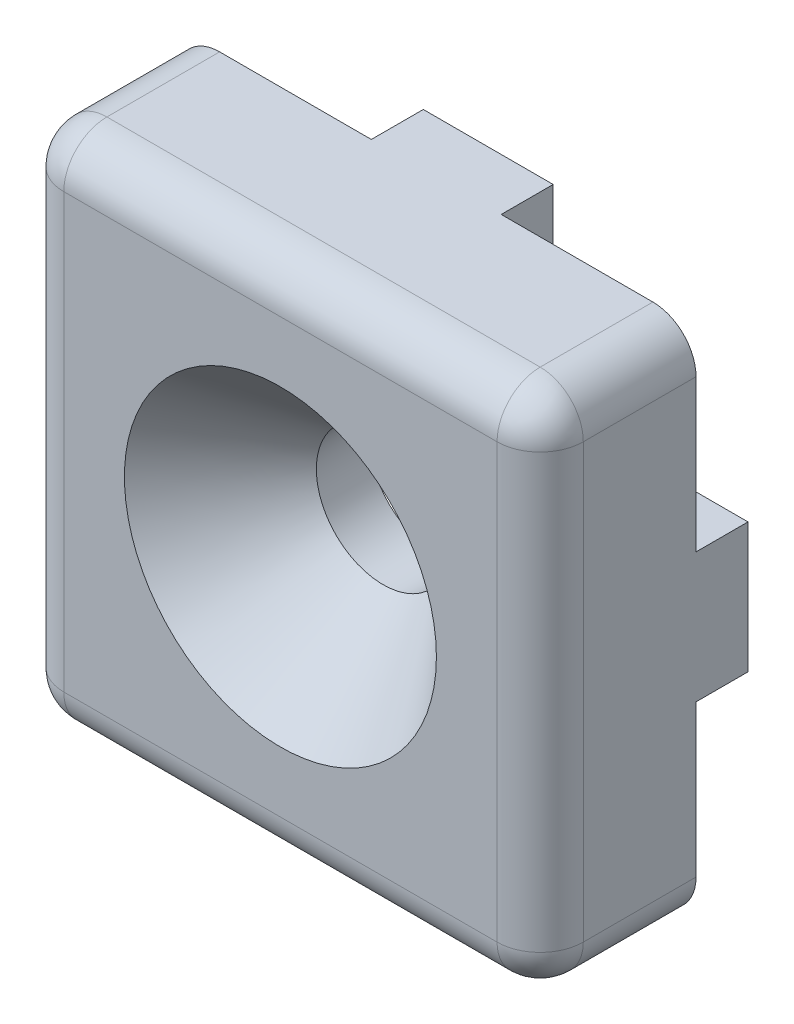
ISO-10303-21;
HEADER;
FILE_DESCRIPTION(('STEP AP214'),'2;1');
FILE_NAME('part.step','',(''),(''),'','','');
FILE_SCHEMA(('AUTOMOTIVE_DESIGN { 1 0 10303 214 1 1 1 1 }'));
ENDSEC;
DATA;
#1=APPLICATION_CONTEXT('core data for automotive mechanical design processes');
#2=APPLICATION_PROTOCOL_DEFINITION('international standard','automotive_design',2000,#1);
#3=PRODUCT_CONTEXT('',#1,'mechanical');
#4=PRODUCT('Part','Part','',(#3));
#5=PRODUCT_RELATED_PRODUCT_CATEGORY('part','',(#4));
#6=PRODUCT_DEFINITION_FORMATION('','',#4);
#7=PRODUCT_DEFINITION_CONTEXT('part definition',#1,'design');
#8=PRODUCT_DEFINITION('design','',#6,#7);
#9=PRODUCT_DEFINITION_SHAPE('','',#8);
#10=(LENGTH_UNIT() NAMED_UNIT(*) SI_UNIT(.MILLI.,.METRE.));
#11=(NAMED_UNIT(*) PLANE_ANGLE_UNIT() SI_UNIT($,.RADIAN.));
#12=(NAMED_UNIT(*) SI_UNIT($,.STERADIAN.) SOLID_ANGLE_UNIT());
#13=UNCERTAINTY_MEASURE_WITH_UNIT(LENGTH_MEASURE(1.E-05),#10,'distance_accuracy_value','');
#14=(GEOMETRIC_REPRESENTATION_CONTEXT(3) GLOBAL_UNCERTAINTY_ASSIGNED_CONTEXT((#13)) GLOBAL_UNIT_ASSIGNED_CONTEXT((#10,
#11,#12)) REPRESENTATION_CONTEXT('',''));
#15=CARTESIAN_POINT('',(0.,0.,0.));
#16=DIRECTION('',(0.,0.,1.));
#17=DIRECTION('',(1.,0.,0.));
#18=AXIS2_PLACEMENT_3D('',#15,#16,#17);
#19=CARTESIAN_POINT('',(0.,0.,-3.81));
#20=DIRECTION('',(0.,0.,-1.));
#21=DIRECTION('',(-1.,0.,0.));
#22=AXIS2_PLACEMENT_3D('',#19,#20,#21);
#23=PLANE('',#22);
#24=CARTESIAN_POINT('',(0.,0.,-3.81));
#25=DIRECTION('',(0.,0.,1.));
#26=DIRECTION('',(1.,0.,0.));
#27=AXIS2_PLACEMENT_3D('',#24,#25,#26);
#28=CIRCLE('',#27,3.2639);
#29=CARTESIAN_POINT('',(3.2639,0.,-3.81));
#30=VERTEX_POINT('',#29);
#31=EDGE_CURVE('E323',#30,#30,#28,.T.);
#32=ORIENTED_EDGE('',*,*,#31,.T.);
#33=EDGE_LOOP('',(#32));
#34=FACE_BOUND('',#33,.T.);
#35=DIRECTION('',(1.,0.,0.));
#36=VECTOR('',#35,1.);
#37=CARTESIAN_POINT('',(-3.1749999999999,-10.16,-3.81));
#38=LINE('',#37,#36);
#39=CARTESIAN_POINT('',(-3.1749999999999,-10.16,-3.81));
#40=VERTEX_POINT('',#39);
#41=CARTESIAN_POINT('',(3.17500000000011,-10.16,-3.81));
#42=VERTEX_POINT('',#41);
#43=EDGE_CURVE('E565',#40,#42,#38,.T.);
#44=ORIENTED_EDGE('',*,*,#43,.F.);
#45=DIRECTION('',(0.,1.,0.));
#46=VECTOR('',#45,1.);
#47=CARTESIAN_POINT('',(-3.17499999999987,-12.7,-3.81));
#48=LINE('',#47,#46);
#49=CARTESIAN_POINT('',(-3.17499999999987,-12.7,-3.81));
#50=VERTEX_POINT('',#49);
#51=EDGE_CURVE('E230',#50,#40,#48,.T.);
#52=ORIENTED_EDGE('',*,*,#51,.F.);
#53=DIRECTION('',(1.,0.,0.));
#54=VECTOR('',#53,1.);
#55=CARTESIAN_POINT('',(-12.7,-12.7,-3.81));
#56=LINE('',#55,#54);
#57=CARTESIAN_POINT('',(-10.5918,-12.7,-3.81));
#58=VERTEX_POINT('',#57);
#59=EDGE_CURVE('E339',#58,#50,#56,.T.);
#60=ORIENTED_EDGE('',*,*,#59,.F.);
#61=CARTESIAN_POINT('',(-10.5918,-10.5918,-3.81));
#62=DIRECTION('',(0.,0.,-1.));
#63=DIRECTION('',(-1.,0.,0.));
#64=AXIS2_PLACEMENT_3D('',#61,#62,#63);
#65=CIRCLE('',#64,2.1082);
#66=CARTESIAN_POINT('',(-12.7,-10.5918,-3.81));
#67=VERTEX_POINT('',#66);
#68=EDGE_CURVE('E41',#58,#67,#65,.T.);
#69=ORIENTED_EDGE('',*,*,#68,.T.);
#70=DIRECTION('',(0.,-1.,0.));
#71=VECTOR('',#70,1.);
#72=CARTESIAN_POINT('',(-12.7,-12.7,-3.81));
#73=LINE('',#72,#71);
#74=CARTESIAN_POINT('',(-12.7,-3.17500000000009,-3.81));
#75=VERTEX_POINT('',#74);
#76=EDGE_CURVE('E334',#75,#67,#73,.T.);
#77=ORIENTED_EDGE('',*,*,#76,.F.);
#78=DIRECTION('',(-1.,0.,0.));
#79=VECTOR('',#78,1.);
#80=CARTESIAN_POINT('',(-12.7,-3.17500000000009,-3.81));
#81=LINE('',#80,#79);
#82=CARTESIAN_POINT('',(-10.16,-3.17500000000007,-3.81));
#83=VERTEX_POINT('',#82);
#84=EDGE_CURVE('E244',#83,#75,#81,.T.);
#85=ORIENTED_EDGE('',*,*,#84,.F.);
#86=DIRECTION('',(0.,-1.,0.));
#87=VECTOR('',#86,1.);
#88=CARTESIAN_POINT('',(-10.16,3.17499999999993,-3.81));
#89=LINE('',#88,#87);
#90=CARTESIAN_POINT('',(-10.16,3.17499999999993,-3.81));
#91=VERTEX_POINT('',#90);
#92=EDGE_CURVE('E235',#91,#83,#89,.T.);
#93=ORIENTED_EDGE('',*,*,#92,.F.);
#94=DIRECTION('',(1.,0.,0.));
#95=VECTOR('',#94,1.);
#96=CARTESIAN_POINT('',(-12.7,3.17499999999991,-3.81));
#97=LINE('',#96,#95);
#98=CARTESIAN_POINT('',(-12.7,3.17499999999991,-3.81));
#99=VERTEX_POINT('',#98);
#100=EDGE_CURVE('E232',#99,#91,#97,.T.);
#101=ORIENTED_EDGE('',*,*,#100,.F.);
#102=CARTESIAN_POINT('',(-12.7,10.5918,-3.81));
#103=VERTEX_POINT('',#102);
#104=EDGE_CURVE('E335',#103,#99,#73,.T.);
#105=ORIENTED_EDGE('',*,*,#104,.F.);
#106=CARTESIAN_POINT('',(-10.5918,10.5918,-3.81));
#107=DIRECTION('',(0.,0.,-1.));
#108=DIRECTION('',(-1.,0.,0.));
#109=AXIS2_PLACEMENT_3D('',#106,#107,#108);
#110=CIRCLE('',#109,2.1082);
#111=CARTESIAN_POINT('',(-10.5918,12.7,-3.81));
#112=VERTEX_POINT('',#111);
#113=EDGE_CURVE('E376',#103,#112,#110,.T.);
#114=ORIENTED_EDGE('',*,*,#113,.T.);
#115=DIRECTION('',(-1.,0.,0.));
#116=VECTOR('',#115,1.);
#117=CARTESIAN_POINT('',(-12.7,12.7,-3.81));
#118=LINE('',#117,#116);
#119=CARTESIAN_POINT('',(-3.17500000000004,12.7,-3.81));
#120=VERTEX_POINT('',#119);
#121=EDGE_CURVE('E330',#120,#112,#118,.T.);
#122=ORIENTED_EDGE('',*,*,#121,.F.);
#123=DIRECTION('',(0.,1.,0.));
#124=VECTOR('',#123,1.);
#125=CARTESIAN_POINT('',(-3.17500000000004,12.7,-3.81));
#126=LINE('',#125,#124);
#127=CARTESIAN_POINT('',(-3.17500000000003,10.16,-3.81));
#128=VERTEX_POINT('',#127);
#129=EDGE_CURVE('E265',#128,#120,#126,.T.);
#130=ORIENTED_EDGE('',*,*,#129,.F.);
#131=DIRECTION('',(-1.,0.,0.));
#132=VECTOR('',#131,1.);
#133=CARTESIAN_POINT('',(3.17499999999997,10.16,-3.81));
#134=LINE('',#133,#132);
#135=CARTESIAN_POINT('',(3.17499999999997,10.16,-3.81));
#136=VERTEX_POINT('',#135);
#137=EDGE_CURVE('E274',#136,#128,#134,.T.);
#138=ORIENTED_EDGE('',*,*,#137,.F.);
#139=DIRECTION('',(0.,-1.,0.));
#140=VECTOR('',#139,1.);
#141=CARTESIAN_POINT('',(3.17499999999996,12.7,-3.81));
#142=LINE('',#141,#140);
#143=CARTESIAN_POINT('',(3.17499999999996,12.7,-3.81));
#144=VERTEX_POINT('',#143);
#145=EDGE_CURVE('E260',#144,#136,#142,.T.);
#146=ORIENTED_EDGE('',*,*,#145,.F.);
#147=CARTESIAN_POINT('',(10.5918,12.7,-3.81));
#148=VERTEX_POINT('',#147);
#149=EDGE_CURVE('E331',#148,#144,#118,.T.);
#150=ORIENTED_EDGE('',*,*,#149,.F.);
#151=CARTESIAN_POINT('',(10.5918,10.5918,-3.81));
#152=DIRECTION('',(0.,0.,-1.));
#153=DIRECTION('',(-1.,0.,0.));
#154=AXIS2_PLACEMENT_3D('',#151,#152,#153);
#155=CIRCLE('',#154,2.1082);
#156=CARTESIAN_POINT('',(12.7,10.5918,-3.81));
#157=VERTEX_POINT('',#156);
#158=EDGE_CURVE('E379',#148,#157,#155,.T.);
#159=ORIENTED_EDGE('',*,*,#158,.T.);
#160=DIRECTION('',(0.,1.,0.));
#161=VECTOR('',#160,1.);
#162=CARTESIAN_POINT('',(12.7,-12.7,-3.81));
#163=LINE('',#162,#161);
#164=CARTESIAN_POINT('',(12.7,3.175,-3.81));
#165=VERTEX_POINT('',#164);
#166=EDGE_CURVE('E326',#165,#157,#163,.T.);
#167=ORIENTED_EDGE('',*,*,#166,.F.);
#168=DIRECTION('',(1.,0.,0.));
#169=VECTOR('',#168,1.);
#170=CARTESIAN_POINT('',(12.7,3.175,-3.81));
#171=LINE('',#170,#169);
#172=CARTESIAN_POINT('',(10.16,3.175,-3.81));
#173=VERTEX_POINT('',#172);
#174=EDGE_CURVE('E291',#173,#165,#171,.T.);
#175=ORIENTED_EDGE('',*,*,#174,.F.);
#176=DIRECTION('',(0.,1.,0.));
#177=VECTOR('',#176,1.);
#178=CARTESIAN_POINT('',(10.16,-3.175,-3.81));
#179=LINE('',#178,#177);
#180=CARTESIAN_POINT('',(10.16,-3.175,-3.81));
#181=VERTEX_POINT('',#180);
#182=EDGE_CURVE('E300',#181,#173,#179,.T.);
#183=ORIENTED_EDGE('',*,*,#182,.F.);
#184=DIRECTION('',(-1.,0.,0.));
#185=VECTOR('',#184,1.);
#186=CARTESIAN_POINT('',(12.7,-3.175,-3.81));
#187=LINE('',#186,#185);
#188=CARTESIAN_POINT('',(12.7,-3.175,-3.81));
#189=VERTEX_POINT('',#188);
#190=EDGE_CURVE('E286',#189,#181,#187,.T.);
#191=ORIENTED_EDGE('',*,*,#190,.F.);
#192=CARTESIAN_POINT('',(12.7,-10.5918,-3.81));
#193=VERTEX_POINT('',#192);
#194=EDGE_CURVE('E327',#193,#189,#163,.T.);
#195=ORIENTED_EDGE('',*,*,#194,.F.);
#196=CARTESIAN_POINT('',(10.5918,-10.5918,-3.81));
#197=DIRECTION('',(0.,0.,-1.));
#198=DIRECTION('',(-1.,0.,0.));
#199=AXIS2_PLACEMENT_3D('',#196,#197,#198);
#200=CIRCLE('',#199,2.1082);
#201=CARTESIAN_POINT('',(10.5918,-12.7,-3.81));
#202=VERTEX_POINT('',#201);
#203=EDGE_CURVE('E11',#193,#202,#200,.T.);
#204=ORIENTED_EDGE('',*,*,#203,.T.);
#205=CARTESIAN_POINT('',(3.17500000000013,-12.7,-3.81));
#206=VERTEX_POINT('',#205);
#207=EDGE_CURVE('E338',#206,#202,#56,.T.);
#208=ORIENTED_EDGE('',*,*,#207,.F.);
#209=DIRECTION('',(0.,-1.,0.));
#210=VECTOR('',#209,1.);
#211=CARTESIAN_POINT('',(3.17500000000013,-12.7,-3.81));
#212=LINE('',#211,#210);
#213=EDGE_CURVE('E226',#42,#206,#212,.T.);
#214=ORIENTED_EDGE('',*,*,#213,.F.);
#215=EDGE_LOOP('',(#44,#52,#60,#69,#77,#85,#93,#101,#105,#114,#122,#130,#138,#146,#150,#159,
#167,#175,#183,#191,#195,#204,#208,#214));
#216=FACE_BOUND('',#215,.T.);
#217=ADVANCED_FACE('F32',(#34,#216),#23,.T.);
#218=CARTESIAN_POINT('',(12.7,-12.7,3.81));
#219=DIRECTION('',(-1.,0.,0.));
#220=DIRECTION('',(0.,0.,1.));
#221=AXIS2_PLACEMENT_3D('',#218,#219,#220);
#222=PLANE('',#221);
#223=DIRECTION('',(0.,1.,0.));
#224=VECTOR('',#223,1.);
#225=CARTESIAN_POINT('',(12.7,-12.7,1.7018));
#226=LINE('',#225,#224);
#227=CARTESIAN_POINT('',(12.7,10.5918,1.7018));
#228=VERTEX_POINT('',#227);
#229=CARTESIAN_POINT('',(12.7,-10.5918,1.7018));
#230=VERTEX_POINT('',#229);
#231=EDGE_CURVE('E366',#228,#230,#226,.F.);
#232=ORIENTED_EDGE('',*,*,#231,.T.);
#233=DIRECTION('',(0.,0.,-1.));
#234=VECTOR('',#233,1.);
#235=CARTESIAN_POINT('',(12.7,-10.5918,3.81));
#236=LINE('',#235,#234);
#237=EDGE_CURVE('E368',#230,#193,#236,.T.);
#238=ORIENTED_EDGE('',*,*,#237,.T.);
#239=ORIENTED_EDGE('',*,*,#194,.T.);
#240=DIRECTION('',(0.,0.,1.));
#241=VECTOR('',#240,1.);
#242=CARTESIAN_POINT('',(12.7,-3.175,-6.35));
#243=LINE('',#242,#241);
#244=CARTESIAN_POINT('',(12.7,-3.175,-6.35));
#245=VERTEX_POINT('',#244);
#246=EDGE_CURVE('E313',#245,#189,#243,.T.);
#247=ORIENTED_EDGE('',*,*,#246,.F.);
#248=DIRECTION('',(0.,-1.,0.));
#249=VECTOR('',#248,1.);
#250=CARTESIAN_POINT('',(12.7,-3.175,-6.35));
#251=LINE('',#250,#249);
#252=CARTESIAN_POINT('',(12.7,3.175,-6.35));
#253=VERTEX_POINT('',#252);
#254=EDGE_CURVE('E287',#253,#245,#251,.T.);
#255=ORIENTED_EDGE('',*,*,#254,.F.);
#256=DIRECTION('',(0.,0.,1.));
#257=VECTOR('',#256,1.);
#258=CARTESIAN_POINT('',(12.7,3.175,-6.35));
#259=LINE('',#258,#257);
#260=EDGE_CURVE('E297',#253,#165,#259,.T.);
#261=ORIENTED_EDGE('',*,*,#260,.T.);
#262=ORIENTED_EDGE('',*,*,#166,.T.);
#263=DIRECTION('',(0.,0.,-1.));
#264=VECTOR('',#263,1.);
#265=CARTESIAN_POINT('',(12.7,10.5918,3.81));
#266=LINE('',#265,#264);
#267=EDGE_CURVE('E364',#157,#228,#266,.F.);
#268=ORIENTED_EDGE('',*,*,#267,.T.);
#269=EDGE_LOOP('',(#232,#238,#239,#247,#255,#261,#262,#268));
#270=FACE_BOUND('',#269,.T.);
#271=ADVANCED_FACE('F440',(#270),#222,.F.);
#272=CARTESIAN_POINT('',(-12.7,12.7,3.81));
#273=DIRECTION('',(0.,-1.,0.));
#274=DIRECTION('',(0.,0.,-1.));
#275=AXIS2_PLACEMENT_3D('',#272,#273,#274);
#276=PLANE('',#275);
#277=DIRECTION('',(-1.,0.,0.));
#278=VECTOR('',#277,1.);
#279=CARTESIAN_POINT('',(-12.7,12.7,1.7018));
#280=LINE('',#279,#278);
#281=CARTESIAN_POINT('',(-10.5918,12.7,1.7018));
#282=VERTEX_POINT('',#281);
#283=CARTESIAN_POINT('',(10.5918,12.7,1.7018));
#284=VERTEX_POINT('',#283);
#285=EDGE_CURVE('E360',#282,#284,#280,.F.);
#286=ORIENTED_EDGE('',*,*,#285,.T.);
#287=DIRECTION('',(0.,0.,-1.));
#288=VECTOR('',#287,1.);
#289=CARTESIAN_POINT('',(10.5918,12.7,3.81));
#290=LINE('',#289,#288);
#291=EDGE_CURVE('E362',#284,#148,#290,.T.);
#292=ORIENTED_EDGE('',*,*,#291,.T.);
#293=ORIENTED_EDGE('',*,*,#149,.T.);
#294=DIRECTION('',(0.,0.,1.));
#295=VECTOR('',#294,1.);
#296=CARTESIAN_POINT('',(3.17499999999996,12.7,-6.35));
#297=LINE('',#296,#295);
#298=CARTESIAN_POINT('',(3.17499999999996,12.7,-6.35));
#299=VERTEX_POINT('',#298);
#300=EDGE_CURVE('E271',#299,#144,#297,.T.);
#301=ORIENTED_EDGE('',*,*,#300,.F.);
#302=DIRECTION('',(1.,0.,0.));
#303=VECTOR('',#302,1.);
#304=CARTESIAN_POINT('',(3.17499999999996,12.7,-6.35));
#305=LINE('',#304,#303);
#306=CARTESIAN_POINT('',(-3.17500000000004,12.7,-6.35));
#307=VERTEX_POINT('',#306);
#308=EDGE_CURVE('E269',#307,#299,#305,.T.);
#309=ORIENTED_EDGE('',*,*,#308,.F.);
#310=DIRECTION('',(0.,0.,1.));
#311=VECTOR('',#310,1.);
#312=CARTESIAN_POINT('',(-3.17500000000004,12.7,-6.35));
#313=LINE('',#312,#311);
#314=EDGE_CURVE('E279',#307,#120,#313,.T.);
#315=ORIENTED_EDGE('',*,*,#314,.T.);
#316=ORIENTED_EDGE('',*,*,#121,.T.);
#317=DIRECTION('',(0.,0.,-1.));
#318=VECTOR('',#317,1.);
#319=CARTESIAN_POINT('',(-10.5918,12.7,3.81));
#320=LINE('',#319,#318);
#321=EDGE_CURVE('E358',#112,#282,#320,.F.);
#322=ORIENTED_EDGE('',*,*,#321,.T.);
#323=EDGE_LOOP('',(#286,#292,#293,#301,#309,#315,#316,#322));
#324=FACE_BOUND('',#323,.T.);
#325=ADVANCED_FACE('F481',(#324),#276,.F.);
#326=CARTESIAN_POINT('',(-12.7,-12.7,3.81));
#327=DIRECTION('',(1.,0.,0.));
#328=DIRECTION('',(0.,0.,-1.));
#329=AXIS2_PLACEMENT_3D('',#326,#327,#328);
#330=PLANE('',#329);
#331=ORIENTED_EDGE('',*,*,#104,.T.);
#332=DIRECTION('',(0.,0.,1.));
#333=VECTOR('',#332,1.);
#334=CARTESIAN_POINT('',(-12.7,3.17499999999991,-6.35));
#335=LINE('',#334,#333);
#336=CARTESIAN_POINT('',(-12.7,3.17499999999991,-6.35));
#337=VERTEX_POINT('',#336);
#338=EDGE_CURVE('E249',#337,#99,#335,.T.);
#339=ORIENTED_EDGE('',*,*,#338,.F.);
#340=DIRECTION('',(0.,1.,0.));
#341=VECTOR('',#340,1.);
#342=CARTESIAN_POINT('',(-12.7,3.17499999999991,-6.35));
#343=LINE('',#342,#341);
#344=CARTESIAN_POINT('',(-12.7,-3.17500000000009,-6.35));
#345=VERTEX_POINT('',#344);
#346=EDGE_CURVE('E248',#345,#337,#343,.T.);
#347=ORIENTED_EDGE('',*,*,#346,.F.);
#348=DIRECTION('',(0.,0.,1.));
#349=VECTOR('',#348,1.);
#350=CARTESIAN_POINT('',(-12.7,-3.17500000000009,-6.35));
#351=LINE('',#350,#349);
#352=EDGE_CURVE('E57',#345,#75,#351,.T.);
#353=ORIENTED_EDGE('',*,*,#352,.T.);
#354=ORIENTED_EDGE('',*,*,#76,.T.);
#355=DIRECTION('',(0.,0.,-1.));
#356=VECTOR('',#355,1.);
#357=CARTESIAN_POINT('',(-12.7,-10.5918,3.81));
#358=LINE('',#357,#356);
#359=CARTESIAN_POINT('',(-12.7,-10.5918,1.7018));
#360=VERTEX_POINT('',#359);
#361=EDGE_CURVE('E356',#67,#360,#358,.F.);
#362=ORIENTED_EDGE('',*,*,#361,.T.);
#363=DIRECTION('',(0.,-1.,0.));
#364=VECTOR('',#363,1.);
#365=CARTESIAN_POINT('',(-12.7,-12.7,1.7018));
#366=LINE('',#365,#364);
#367=CARTESIAN_POINT('',(-12.7,10.5918,1.7018));
#368=VERTEX_POINT('',#367);
#369=EDGE_CURVE('E353',#360,#368,#366,.F.);
#370=ORIENTED_EDGE('',*,*,#369,.T.);
#371=DIRECTION('',(0.,0.,-1.));
#372=VECTOR('',#371,1.);
#373=CARTESIAN_POINT('',(-12.7,10.5918,3.81));
#374=LINE('',#373,#372);
#375=EDGE_CURVE('E351',#368,#103,#374,.T.);
#376=ORIENTED_EDGE('',*,*,#375,.T.);
#377=EDGE_LOOP('',(#331,#339,#347,#353,#354,#362,#370,#376));
#378=FACE_BOUND('',#377,.T.);
#379=ADVANCED_FACE('F489',(#378),#330,.F.);
#380=CARTESIAN_POINT('',(-12.7,-12.7,3.81));
#381=DIRECTION('',(0.,1.,0.));
#382=DIRECTION('',(0.,0.,1.));
#383=AXIS2_PLACEMENT_3D('',#380,#381,#382);
#384=PLANE('',#383);
#385=ORIENTED_EDGE('',*,*,#59,.T.);
#386=DIRECTION('',(0.,0.,1.));
#387=VECTOR('',#386,1.);
#388=CARTESIAN_POINT('',(-3.17499999999987,-12.7,-6.35));
#389=LINE('',#388,#387);
#390=CARTESIAN_POINT('',(-3.17499999999987,-12.7,-6.35));
#391=VERTEX_POINT('',#390);
#392=EDGE_CURVE('E560',#391,#50,#389,.T.);
#393=ORIENTED_EDGE('',*,*,#392,.F.);
#394=DIRECTION('',(-1.,0.,0.));
#395=VECTOR('',#394,1.);
#396=CARTESIAN_POINT('',(-3.17499999999987,-12.7,-6.35));
#397=LINE('',#396,#395);
#398=CARTESIAN_POINT('',(3.17500000000013,-12.7,-6.35));
#399=VERTEX_POINT('',#398);
#400=EDGE_CURVE('E223',#399,#391,#397,.T.);
#401=ORIENTED_EDGE('',*,*,#400,.F.);
#402=DIRECTION('',(0.,0.,1.));
#403=VECTOR('',#402,1.);
#404=CARTESIAN_POINT('',(3.17500000000013,-12.7,-6.35));
#405=LINE('',#404,#403);
#406=EDGE_CURVE('E49',#399,#206,#405,.T.);
#407=ORIENTED_EDGE('',*,*,#406,.T.);
#408=ORIENTED_EDGE('',*,*,#207,.T.);
#409=DIRECTION('',(0.,0.,-1.));
#410=VECTOR('',#409,1.);
#411=CARTESIAN_POINT('',(10.5918,-12.7,3.81));
#412=LINE('',#411,#410);
#413=CARTESIAN_POINT('',(10.5918,-12.7,1.7018));
#414=VERTEX_POINT('',#413);
#415=EDGE_CURVE('E374',#202,#414,#412,.F.);
#416=ORIENTED_EDGE('',*,*,#415,.T.);
#417=DIRECTION('',(1.,0.,0.));
#418=VECTOR('',#417,1.);
#419=CARTESIAN_POINT('',(-12.7,-12.7,1.7018));
#420=LINE('',#419,#418);
#421=CARTESIAN_POINT('',(-10.5918,-12.7,1.7018));
#422=VERTEX_POINT('',#421);
#423=EDGE_CURVE('E372',#414,#422,#420,.F.);
#424=ORIENTED_EDGE('',*,*,#423,.T.);
#425=DIRECTION('',(0.,0.,-1.));
#426=VECTOR('',#425,1.);
#427=CARTESIAN_POINT('',(-10.5918,-12.7,3.81));
#428=LINE('',#427,#426);
#429=EDGE_CURVE('E370',#422,#58,#428,.T.);
#430=ORIENTED_EDGE('',*,*,#429,.T.);
#431=EDGE_LOOP('',(#385,#393,#401,#407,#408,#416,#424,#430));
#432=FACE_BOUND('',#431,.T.);
#433=ADVANCED_FACE('F486',(#432),#384,.F.);
#434=CARTESIAN_POINT('',(0.,0.,3.81));
#435=DIRECTION('',(0.,0.,-1.));
#436=DIRECTION('',(-1.,0.,0.));
#437=AXIS2_PLACEMENT_3D('',#434,#435,#436);
#438=PLANE('',#437);
#439=DIRECTION('',(-1.,0.,0.));
#440=VECTOR('',#439,1.);
#441=CARTESIAN_POINT('',(0.,10.5918,3.81));
#442=LINE('',#441,#440);
#443=CARTESIAN_POINT('',(10.5918,10.5918,3.81));
#444=VERTEX_POINT('',#443);
#445=CARTESIAN_POINT('',(-10.5918,10.5918,3.81));
#446=VERTEX_POINT('',#445);
#447=EDGE_CURVE('E346',#444,#446,#442,.T.);
#448=ORIENTED_EDGE('',*,*,#447,.T.);
#449=DIRECTION('',(0.,-1.,0.));
#450=VECTOR('',#449,1.);
#451=CARTESIAN_POINT('',(-10.5918,0.,3.81));
#452=LINE('',#451,#450);
#453=CARTESIAN_POINT('',(-10.5918,-10.5918,3.81));
#454=VERTEX_POINT('',#453);
#455=EDGE_CURVE('E348',#446,#454,#452,.T.);
#456=ORIENTED_EDGE('',*,*,#455,.T.);
#457=DIRECTION('',(1.,0.,0.));
#458=VECTOR('',#457,1.);
#459=CARTESIAN_POINT('',(0.,-10.5918,3.81));
#460=LINE('',#459,#458);
#461=CARTESIAN_POINT('',(10.5918,-10.5918,3.81));
#462=VERTEX_POINT('',#461);
#463=EDGE_CURVE('E342',#454,#462,#460,.T.);
#464=ORIENTED_EDGE('',*,*,#463,.T.);
#465=DIRECTION('',(0.,1.,0.));
#466=VECTOR('',#465,1.);
#467=CARTESIAN_POINT('',(10.5918,0.,3.81));
#468=LINE('',#467,#466);
#469=EDGE_CURVE('E344',#462,#444,#468,.T.);
#470=ORIENTED_EDGE('',*,*,#469,.T.);
#471=EDGE_LOOP('',(#448,#456,#464,#470));
#472=FACE_BOUND('',#471,.T.);
#473=CARTESIAN_POINT('',(0.,0.,3.81));
#474=DIRECTION('',(0.,0.,1.));
#475=DIRECTION('',(1.,0.,0.));
#476=AXIS2_PLACEMENT_3D('',#473,#474,#475);
#477=CIRCLE('',#476,7.6268961);
#478=CARTESIAN_POINT('',(7.6268961,0.,3.81));
#479=VERTEX_POINT('',#478);
#480=EDGE_CURVE('E317',#479,#479,#477,.T.);
#481=ORIENTED_EDGE('',*,*,#480,.F.);
#482=EDGE_LOOP('',(#481));
#483=FACE_BOUND('',#482,.T.);
#484=ADVANCED_FACE('F429',(#472,#483),#438,.F.);
#485=CARTESIAN_POINT('',(0.,0.,3.81));
#486=DIRECTION('',(0.,0.,1.));
#487=DIRECTION('',(1.,0.,0.));
#488=AXIS2_PLACEMENT_3D('',#485,#486,#487);
#489=CYLINDRICAL_SURFACE('',#488,3.2639);
#490=ORIENTED_EDGE('',*,*,#31,.F.);
#491=EDGE_LOOP('',(#490));
#492=FACE_BOUND('',#491,.T.);
#493=CARTESIAN_POINT('',(0.,0.,-1.20905287426848));
#494=DIRECTION('',(0.,0.,1.));
#495=DIRECTION('',(1.,0.,0.));
#496=AXIS2_PLACEMENT_3D('',#493,#494,#495);
#497=CIRCLE('',#496,3.2639);
#498=CARTESIAN_POINT('',(3.2639,0.,-1.20905287426848));
#499=VERTEX_POINT('',#498);
#500=EDGE_CURVE('E320',#499,#499,#497,.T.);
#501=ORIENTED_EDGE('',*,*,#500,.T.);
#502=EDGE_LOOP('',(#501));
#503=FACE_BOUND('',#502,.T.);
#504=ADVANCED_FACE('F535',(#492,#503),#489,.F.);
#505=CARTESIAN_POINT('',(0.,0.,3.81));
#506=DIRECTION('',(0.,0.,1.));
#507=DIRECTION('',(1.,0.,0.));
#508=AXIS2_PLACEMENT_3D('',#505,#506,#507);
#509=CONICAL_SURFACE('',#508,7.6268961,0.715584993317675);
#510=ORIENTED_EDGE('',*,*,#500,.F.);
#511=EDGE_LOOP('',(#510));
#512=FACE_BOUND('',#511,.T.);
#513=ORIENTED_EDGE('',*,*,#480,.T.);
#514=EDGE_LOOP('',(#513));
#515=FACE_BOUND('',#514,.T.);
#516=ADVANCED_FACE('F531',(#512,#515),#509,.F.);
#517=CARTESIAN_POINT('',(10.5918,10.5918,3.81));
#518=DIRECTION('',(0.,0.,-1.));
#519=DIRECTION('',(-1.,0.,0.));
#520=AXIS2_PLACEMENT_3D('',#517,#518,#519);
#521=CYLINDRICAL_SURFACE('',#520,2.1082);
#522=ORIENTED_EDGE('',*,*,#158,.F.);
#523=ORIENTED_EDGE('',*,*,#291,.F.);
#524=CARTESIAN_POINT('',(10.5918,10.5918,1.7018));
#525=DIRECTION('',(0.,0.,1.));
#526=DIRECTION('',(1.,0.,0.));
#527=AXIS2_PLACEMENT_3D('',#524,#525,#526);
#528=CIRCLE('',#527,2.1082);
#529=EDGE_CURVE('E36',#228,#284,#528,.T.);
#530=ORIENTED_EDGE('',*,*,#529,.F.);
#531=ORIENTED_EDGE('',*,*,#267,.F.);
#532=EDGE_LOOP('',(#522,#523,#530,#531));
#533=FACE_BOUND('',#532,.T.);
#534=ADVANCED_FACE('F34',(#533),#521,.T.);
#535=CARTESIAN_POINT('',(10.5918,0.,1.7018));
#536=DIRECTION('',(0.,1.,0.));
#537=DIRECTION('',(0.,0.,1.));
#538=AXIS2_PLACEMENT_3D('',#535,#536,#537);
#539=CYLINDRICAL_SURFACE('',#538,2.1082);
#540=CARTESIAN_POINT('',(10.5918,-10.5918,1.7018));
#541=DIRECTION('',(0.,-1.,0.));
#542=DIRECTION('',(0.,0.,-1.));
#543=AXIS2_PLACEMENT_3D('',#540,#541,#542);
#544=CIRCLE('',#543,2.1082);
#545=EDGE_CURVE('E408',#230,#462,#544,.T.);
#546=ORIENTED_EDGE('',*,*,#545,.F.);
#547=ORIENTED_EDGE('',*,*,#231,.F.);
#548=CARTESIAN_POINT('',(10.5918,10.5918,1.7018));
#549=DIRECTION('',(0.,1.,0.));
#550=DIRECTION('',(0.,0.,1.));
#551=AXIS2_PLACEMENT_3D('',#548,#549,#550);
#552=CIRCLE('',#551,2.1082);
#553=EDGE_CURVE('E410',#444,#228,#552,.T.);
#554=ORIENTED_EDGE('',*,*,#553,.F.);
#555=ORIENTED_EDGE('',*,*,#469,.F.);
#556=EDGE_LOOP('',(#546,#547,#554,#555));
#557=FACE_BOUND('',#556,.T.);
#558=ADVANCED_FACE('F437',(#557),#539,.T.);
#559=CARTESIAN_POINT('',(10.5918,-10.5918,3.81));
#560=DIRECTION('',(0.,0.,-1.));
#561=DIRECTION('',(-1.,0.,0.));
#562=AXIS2_PLACEMENT_3D('',#559,#560,#561);
#563=CYLINDRICAL_SURFACE('',#562,2.1082);
#564=ORIENTED_EDGE('',*,*,#203,.F.);
#565=ORIENTED_EDGE('',*,*,#237,.F.);
#566=CARTESIAN_POINT('',(10.5918,-10.5918,1.7018));
#567=DIRECTION('',(0.,0.,1.));
#568=DIRECTION('',(1.,0.,0.));
#569=AXIS2_PLACEMENT_3D('',#566,#567,#568);
#570=CIRCLE('',#569,2.1082);
#571=EDGE_CURVE('E405',#414,#230,#570,.T.);
#572=ORIENTED_EDGE('',*,*,#571,.F.);
#573=ORIENTED_EDGE('',*,*,#415,.F.);
#574=EDGE_LOOP('',(#564,#565,#572,#573));
#575=FACE_BOUND('',#574,.T.);
#576=ADVANCED_FACE('F445',(#575),#563,.T.);
#577=CARTESIAN_POINT('',(10.5918,10.5918,1.7018));
#578=DIRECTION('',(0.,0.,1.));
#579=DIRECTION('',(1.,0.,0.));
#580=AXIS2_PLACEMENT_3D('',#577,#578,#579);
#581=SPHERICAL_SURFACE('',#580,2.1082);
#582=ORIENTED_EDGE('',*,*,#553,.T.);
#583=ORIENTED_EDGE('',*,*,#529,.T.);
#584=CARTESIAN_POINT('',(10.5918,10.5918,1.7018));
#585=DIRECTION('',(1.,0.,0.));
#586=DIRECTION('',(0.,0.,-1.));
#587=AXIS2_PLACEMENT_3D('',#584,#585,#586);
#588=CIRCLE('',#587,2.1082);
#589=EDGE_CURVE('E402',#444,#284,#588,.F.);
#590=ORIENTED_EDGE('',*,*,#589,.F.);
#591=EDGE_LOOP('',(#582,#583,#590));
#592=FACE_BOUND('',#591,.T.);
#593=ADVANCED_FACE('F417',(#592),#581,.T.);
#594=CARTESIAN_POINT('',(10.5918,-10.5918,1.7018));
#595=DIRECTION('',(0.,0.,1.));
#596=DIRECTION('',(1.,0.,0.));
#597=AXIS2_PLACEMENT_3D('',#594,#595,#596);
#598=SPHERICAL_SURFACE('',#597,2.1082);
#599=ORIENTED_EDGE('',*,*,#571,.T.);
#600=ORIENTED_EDGE('',*,*,#545,.T.);
#601=CARTESIAN_POINT('',(10.5918,-10.5918,1.7018));
#602=DIRECTION('',(1.,0.,0.));
#603=DIRECTION('',(0.,0.,-1.));
#604=AXIS2_PLACEMENT_3D('',#601,#602,#603);
#605=CIRCLE('',#604,2.1082);
#606=EDGE_CURVE('E399',#414,#462,#605,.F.);
#607=ORIENTED_EDGE('',*,*,#606,.F.);
#608=EDGE_LOOP('',(#599,#600,#607));
#609=FACE_BOUND('',#608,.T.);
#610=ADVANCED_FACE('F519',(#609),#598,.T.);
#611=CARTESIAN_POINT('',(-10.5918,10.5918,3.81));
#612=DIRECTION('',(0.,0.,-1.));
#613=DIRECTION('',(-1.,0.,0.));
#614=AXIS2_PLACEMENT_3D('',#611,#612,#613);
#615=CYLINDRICAL_SURFACE('',#614,2.1082);
#616=ORIENTED_EDGE('',*,*,#113,.F.);
#617=ORIENTED_EDGE('',*,*,#375,.F.);
#618=CARTESIAN_POINT('',(-10.5918,10.5918,1.7018));
#619=DIRECTION('',(0.,0.,1.));
#620=DIRECTION('',(1.,0.,0.));
#621=AXIS2_PLACEMENT_3D('',#618,#619,#620);
#622=CIRCLE('',#621,2.1082);
#623=EDGE_CURVE('E396',#282,#368,#622,.T.);
#624=ORIENTED_EDGE('',*,*,#623,.F.);
#625=ORIENTED_EDGE('',*,*,#321,.F.);
#626=EDGE_LOOP('',(#616,#617,#624,#625));
#627=FACE_BOUND('',#626,.T.);
#628=ADVANCED_FACE('F516',(#627),#615,.T.);
#629=CARTESIAN_POINT('',(0.,10.5918,1.7018));
#630=DIRECTION('',(-1.,0.,0.));
#631=DIRECTION('',(0.,0.,1.));
#632=AXIS2_PLACEMENT_3D('',#629,#630,#631);
#633=CYLINDRICAL_SURFACE('',#632,2.1082);
#634=ORIENTED_EDGE('',*,*,#589,.T.);
#635=ORIENTED_EDGE('',*,*,#285,.F.);
#636=CARTESIAN_POINT('',(-10.5918,10.5918,1.7018));
#637=DIRECTION('',(-1.,0.,0.));
#638=DIRECTION('',(0.,0.,1.));
#639=AXIS2_PLACEMENT_3D('',#636,#637,#638);
#640=CIRCLE('',#639,2.1082);
#641=EDGE_CURVE('E393',#446,#282,#640,.T.);
#642=ORIENTED_EDGE('',*,*,#641,.F.);
#643=ORIENTED_EDGE('',*,*,#447,.F.);
#644=EDGE_LOOP('',(#634,#635,#642,#643));
#645=FACE_BOUND('',#644,.T.);
#646=ADVANCED_FACE('F424',(#645),#633,.T.);
#647=CARTESIAN_POINT('',(0.,-10.5918,1.7018));
#648=DIRECTION('',(1.,0.,0.));
#649=DIRECTION('',(0.,0.,-1.));
#650=AXIS2_PLACEMENT_3D('',#647,#648,#649);
#651=CYLINDRICAL_SURFACE('',#650,2.1082);
#652=ORIENTED_EDGE('',*,*,#606,.T.);
#653=ORIENTED_EDGE('',*,*,#463,.F.);
#654=CARTESIAN_POINT('',(-10.5918,-10.5918,1.7018));
#655=DIRECTION('',(-1.,0.,0.));
#656=DIRECTION('',(0.,0.,1.));
#657=AXIS2_PLACEMENT_3D('',#654,#655,#656);
#658=CIRCLE('',#657,2.1082);
#659=EDGE_CURVE('E390',#422,#454,#658,.T.);
#660=ORIENTED_EDGE('',*,*,#659,.F.);
#661=ORIENTED_EDGE('',*,*,#423,.F.);
#662=EDGE_LOOP('',(#652,#653,#660,#661));
#663=FACE_BOUND('',#662,.T.);
#664=ADVANCED_FACE('F509',(#663),#651,.T.);
#665=CARTESIAN_POINT('',(-10.5918,-10.5918,3.81));
#666=DIRECTION('',(0.,0.,-1.));
#667=DIRECTION('',(-1.,0.,0.));
#668=AXIS2_PLACEMENT_3D('',#665,#666,#667);
#669=CYLINDRICAL_SURFACE('',#668,2.1082);
#670=ORIENTED_EDGE('',*,*,#68,.F.);
#671=ORIENTED_EDGE('',*,*,#429,.F.);
#672=CARTESIAN_POINT('',(-10.5918,-10.5918,1.7018));
#673=DIRECTION('',(0.,0.,1.));
#674=DIRECTION('',(1.,0.,0.));
#675=AXIS2_PLACEMENT_3D('',#672,#673,#674);
#676=CIRCLE('',#675,2.1082);
#677=EDGE_CURVE('E387',#360,#422,#676,.T.);
#678=ORIENTED_EDGE('',*,*,#677,.F.);
#679=ORIENTED_EDGE('',*,*,#361,.F.);
#680=EDGE_LOOP('',(#670,#671,#678,#679));
#681=FACE_BOUND('',#680,.T.);
#682=ADVANCED_FACE('F505',(#681),#669,.T.);
#683=CARTESIAN_POINT('',(-10.5918,10.5918,1.7018));
#684=DIRECTION('',(0.,0.,1.));
#685=DIRECTION('',(1.,0.,0.));
#686=AXIS2_PLACEMENT_3D('',#683,#684,#685);
#687=SPHERICAL_SURFACE('',#686,2.1082);
#688=ORIENTED_EDGE('',*,*,#641,.T.);
#689=ORIENTED_EDGE('',*,*,#623,.T.);
#690=CARTESIAN_POINT('',(-10.5918,10.5918,1.7018));
#691=DIRECTION('',(0.,1.,0.));
#692=DIRECTION('',(0.,0.,1.));
#693=AXIS2_PLACEMENT_3D('',#690,#691,#692);
#694=CIRCLE('',#693,2.1082);
#695=EDGE_CURVE('E385',#446,#368,#694,.F.);
#696=ORIENTED_EDGE('',*,*,#695,.F.);
#697=EDGE_LOOP('',(#688,#689,#696));
#698=FACE_BOUND('',#697,.T.);
#699=ADVANCED_FACE('F501',(#698),#687,.T.);
#700=CARTESIAN_POINT('',(-10.5918,-10.5918,1.7018));
#701=DIRECTION('',(0.,0.,1.));
#702=DIRECTION('',(1.,0.,0.));
#703=AXIS2_PLACEMENT_3D('',#700,#701,#702);
#704=SPHERICAL_SURFACE('',#703,2.1082);
#705=ORIENTED_EDGE('',*,*,#677,.T.);
#706=ORIENTED_EDGE('',*,*,#659,.T.);
#707=CARTESIAN_POINT('',(-10.5918,-10.5918,1.7018));
#708=DIRECTION('',(0.,-1.,0.));
#709=DIRECTION('',(0.,0.,-1.));
#710=AXIS2_PLACEMENT_3D('',#707,#708,#709);
#711=CIRCLE('',#710,2.1082);
#712=EDGE_CURVE('E316',#360,#454,#711,.F.);
#713=ORIENTED_EDGE('',*,*,#712,.F.);
#714=EDGE_LOOP('',(#705,#706,#713));
#715=FACE_BOUND('',#714,.T.);
#716=ADVANCED_FACE('F497',(#715),#704,.T.);
#717=CARTESIAN_POINT('',(-10.5918,0.,1.7018));
#718=DIRECTION('',(0.,-1.,0.));
#719=DIRECTION('',(0.,0.,-1.));
#720=AXIS2_PLACEMENT_3D('',#717,#718,#719);
#721=CYLINDRICAL_SURFACE('',#720,2.1082);
#722=ORIENTED_EDGE('',*,*,#695,.T.);
#723=ORIENTED_EDGE('',*,*,#369,.F.);
#724=ORIENTED_EDGE('',*,*,#712,.T.);
#725=ORIENTED_EDGE('',*,*,#455,.F.);
#726=EDGE_LOOP('',(#722,#723,#724,#725));
#727=FACE_BOUND('',#726,.T.);
#728=ADVANCED_FACE('F473',(#727),#721,.T.);
#729=CARTESIAN_POINT('',(12.7,-3.175,-6.35));
#730=DIRECTION('',(0.,1.,0.));
#731=DIRECTION('',(0.,0.,1.));
#732=AXIS2_PLACEMENT_3D('',#729,#730,#731);
#733=PLANE('',#732);
#734=ORIENTED_EDGE('',*,*,#190,.T.);
#735=DIRECTION('',(0.,0.,1.));
#736=VECTOR('',#735,1.);
#737=CARTESIAN_POINT('',(10.16,-3.175,-6.35));
#738=LINE('',#737,#736);
#739=CARTESIAN_POINT('',(10.16,-3.175,-6.35));
#740=VERTEX_POINT('',#739);
#741=EDGE_CURVE('E310',#740,#181,#738,.T.);
#742=ORIENTED_EDGE('',*,*,#741,.F.);
#743=DIRECTION('',(-1.,0.,0.));
#744=VECTOR('',#743,1.);
#745=CARTESIAN_POINT('',(12.7,-3.175,-6.35));
#746=LINE('',#745,#744);
#747=EDGE_CURVE('E290',#245,#740,#746,.T.);
#748=ORIENTED_EDGE('',*,*,#747,.F.);
#749=ORIENTED_EDGE('',*,*,#246,.T.);
#750=EDGE_LOOP('',(#734,#742,#748,#749));
#751=FACE_BOUND('',#750,.T.);
#752=ADVANCED_FACE('F454',(#751),#733,.F.);
#753=CARTESIAN_POINT('',(10.16,-3.175,-6.35));
#754=DIRECTION('',(1.,0.,0.));
#755=DIRECTION('',(0.,0.,-1.));
#756=AXIS2_PLACEMENT_3D('',#753,#754,#755);
#757=PLANE('',#756);
#758=ORIENTED_EDGE('',*,*,#182,.T.);
#759=DIRECTION('',(0.,0.,1.));
#760=VECTOR('',#759,1.);
#761=CARTESIAN_POINT('',(10.16,3.175,-6.35));
#762=LINE('',#761,#760);
#763=CARTESIAN_POINT('',(10.16,3.175,-6.35));
#764=VERTEX_POINT('',#763);
#765=EDGE_CURVE('E307',#764,#173,#762,.T.);
#766=ORIENTED_EDGE('',*,*,#765,.F.);
#767=DIRECTION('',(0.,1.,0.));
#768=VECTOR('',#767,1.);
#769=CARTESIAN_POINT('',(10.16,-3.175,-6.35));
#770=LINE('',#769,#768);
#771=EDGE_CURVE('E293',#740,#764,#770,.T.);
#772=ORIENTED_EDGE('',*,*,#771,.F.);
#773=ORIENTED_EDGE('',*,*,#741,.T.);
#774=EDGE_LOOP('',(#758,#766,#772,#773));
#775=FACE_BOUND('',#774,.T.);
#776=ADVANCED_FACE('F465',(#775),#757,.F.);
#777=CARTESIAN_POINT('',(12.7,3.175,-6.35));
#778=DIRECTION('',(0.,-1.,0.));
#779=DIRECTION('',(1.,0.,0.));
#780=AXIS2_PLACEMENT_3D('',#777,#778,#779);
#781=PLANE('',#780);
#782=ORIENTED_EDGE('',*,*,#174,.T.);
#783=ORIENTED_EDGE('',*,*,#260,.F.);
#784=DIRECTION('',(1.,0.,0.));
#785=VECTOR('',#784,1.);
#786=CARTESIAN_POINT('',(12.7,3.175,-6.35));
#787=LINE('',#786,#785);
#788=EDGE_CURVE('E295',#764,#253,#787,.T.);
#789=ORIENTED_EDGE('',*,*,#788,.F.);
#790=ORIENTED_EDGE('',*,*,#765,.T.);
#791=EDGE_LOOP('',(#782,#783,#789,#790));
#792=FACE_BOUND('',#791,.T.);
#793=ADVANCED_FACE('F462',(#792),#781,.F.);
#794=CARTESIAN_POINT('',(0.,0.,-6.35));
#795=DIRECTION('',(0.,0.,1.));
#796=DIRECTION('',(1.,0.,0.));
#797=AXIS2_PLACEMENT_3D('',#794,#795,#796);
#798=PLANE('',#797);
#799=ORIENTED_EDGE('',*,*,#254,.T.);
#800=ORIENTED_EDGE('',*,*,#747,.T.);
#801=ORIENTED_EDGE('',*,*,#771,.T.);
#802=ORIENTED_EDGE('',*,*,#788,.T.);
#803=EDGE_LOOP('',(#799,#800,#801,#802));
#804=FACE_BOUND('',#803,.T.);
#805=ADVANCED_FACE('F458',(#804),#798,.F.);
#806=CARTESIAN_POINT('',(3.17499999999996,12.7,-6.35));
#807=DIRECTION('',(-1.,0.,0.));
#808=DIRECTION('',(0.,-1.,0.));
#809=AXIS2_PLACEMENT_3D('',#806,#807,#808);
#810=PLANE('',#809);
#811=ORIENTED_EDGE('',*,*,#145,.T.);
#812=DIRECTION('',(0.,0.,1.));
#813=VECTOR('',#812,1.);
#814=CARTESIAN_POINT('',(3.17499999999997,10.16,-6.35));
#815=LINE('',#814,#813);
#816=CARTESIAN_POINT('',(3.17499999999997,10.16,-6.35));
#817=VERTEX_POINT('',#816);
#818=EDGE_CURVE('E284',#817,#136,#815,.T.);
#819=ORIENTED_EDGE('',*,*,#818,.F.);
#820=DIRECTION('',(0.,-1.,0.));
#821=VECTOR('',#820,1.);
#822=CARTESIAN_POINT('',(3.17499999999996,12.7,-6.35));
#823=LINE('',#822,#821);
#824=EDGE_CURVE('E261',#299,#817,#823,.T.);
#825=ORIENTED_EDGE('',*,*,#824,.F.);
#826=ORIENTED_EDGE('',*,*,#300,.T.);
#827=EDGE_LOOP('',(#811,#819,#825,#826));
#828=FACE_BOUND('',#827,.T.);
#829=ADVANCED_FACE('F608',(#828),#810,.F.);
#830=CARTESIAN_POINT('',(3.17499999999997,10.16,-6.35));
#831=DIRECTION('',(0.,1.,0.));
#832=DIRECTION('',(-1.,0.,0.));
#833=AXIS2_PLACEMENT_3D('',#830,#831,#832);
#834=PLANE('',#833);
#835=ORIENTED_EDGE('',*,*,#137,.T.);
#836=DIRECTION('',(0.,0.,1.));
#837=VECTOR('',#836,1.);
#838=CARTESIAN_POINT('',(-3.17500000000003,10.16,-6.35));
#839=LINE('',#838,#837);
#840=CARTESIAN_POINT('',(-3.17500000000003,10.16,-6.35));
#841=VERTEX_POINT('',#840);
#842=EDGE_CURVE('E281',#841,#128,#839,.T.);
#843=ORIENTED_EDGE('',*,*,#842,.F.);
#844=DIRECTION('',(-1.,0.,0.));
#845=VECTOR('',#844,1.);
#846=CARTESIAN_POINT('',(3.17499999999997,10.16,-6.35));
#847=LINE('',#846,#845);
#848=EDGE_CURVE('E264',#817,#841,#847,.T.);
#849=ORIENTED_EDGE('',*,*,#848,.F.);
#850=ORIENTED_EDGE('',*,*,#818,.T.);
#851=EDGE_LOOP('',(#835,#843,#849,#850));
#852=FACE_BOUND('',#851,.T.);
#853=ADVANCED_FACE('F604',(#852),#834,.F.);
#854=CARTESIAN_POINT('',(-3.17500000000004,12.7,-6.35));
#855=DIRECTION('',(1.,0.,0.));
#856=DIRECTION('',(0.,1.,0.));
#857=AXIS2_PLACEMENT_3D('',#854,#855,#856);
#858=PLANE('',#857);
#859=ORIENTED_EDGE('',*,*,#129,.T.);
#860=ORIENTED_EDGE('',*,*,#314,.F.);
#861=DIRECTION('',(0.,1.,0.));
#862=VECTOR('',#861,1.);
#863=CARTESIAN_POINT('',(-3.17500000000004,12.7,-6.35));
#864=LINE('',#863,#862);
#865=EDGE_CURVE('E267',#841,#307,#864,.T.);
#866=ORIENTED_EDGE('',*,*,#865,.F.);
#867=ORIENTED_EDGE('',*,*,#842,.T.);
#868=EDGE_LOOP('',(#859,#860,#866,#867));
#869=FACE_BOUND('',#868,.T.);
#870=ADVANCED_FACE('F600',(#869),#858,.F.);
#871=CARTESIAN_POINT('',(0.,0.,-6.35));
#872=DIRECTION('',(0.,0.,-1.));
#873=DIRECTION('',(-1.,0.,0.));
#874=AXIS2_PLACEMENT_3D('',#871,#872,#873);
#875=PLANE('',#874);
#876=ORIENTED_EDGE('',*,*,#824,.T.);
#877=ORIENTED_EDGE('',*,*,#848,.T.);
#878=ORIENTED_EDGE('',*,*,#865,.T.);
#879=ORIENTED_EDGE('',*,*,#308,.T.);
#880=EDGE_LOOP('',(#876,#877,#878,#879));
#881=FACE_BOUND('',#880,.T.);
#882=ADVANCED_FACE('F596',(#881),#875,.T.);
#883=CARTESIAN_POINT('',(-12.7,3.17499999999991,-6.35));
#884=DIRECTION('',(0.,-1.,0.));
#885=DIRECTION('',(1.,0.,0.));
#886=AXIS2_PLACEMENT_3D('',#883,#884,#885);
#887=PLANE('',#886);
#888=ORIENTED_EDGE('',*,*,#100,.T.);
#889=DIRECTION('',(0.,0.,1.));
#890=VECTOR('',#889,1.);
#891=CARTESIAN_POINT('',(-10.16,3.17499999999993,-6.35));
#892=LINE('',#891,#890);
#893=CARTESIAN_POINT('',(-10.16,3.17499999999993,-6.35));
#894=VERTEX_POINT('',#893);
#895=EDGE_CURVE('E258',#894,#91,#892,.T.);
#896=ORIENTED_EDGE('',*,*,#895,.F.);
#897=DIRECTION('',(1.,0.,0.));
#898=VECTOR('',#897,1.);
#899=CARTESIAN_POINT('',(-12.7,3.17499999999991,-6.35));
#900=LINE('',#899,#898);
#901=EDGE_CURVE('E240',#337,#894,#900,.T.);
#902=ORIENTED_EDGE('',*,*,#901,.F.);
#903=ORIENTED_EDGE('',*,*,#338,.T.);
#904=EDGE_LOOP('',(#888,#896,#902,#903));
#905=FACE_BOUND('',#904,.T.);
#906=ADVANCED_FACE('F592',(#905),#887,.F.);
#907=CARTESIAN_POINT('',(-10.16,3.17499999999993,-6.35));
#908=DIRECTION('',(-1.,0.,0.));
#909=DIRECTION('',(0.,-1.,0.));
#910=AXIS2_PLACEMENT_3D('',#907,#908,#909);
#911=PLANE('',#910);
#912=ORIENTED_EDGE('',*,*,#92,.T.);
#913=DIRECTION('',(0.,0.,1.));
#914=VECTOR('',#913,1.);
#915=CARTESIAN_POINT('',(-10.16,-3.17500000000007,-6.35));
#916=LINE('',#915,#914);
#917=CARTESIAN_POINT('',(-10.16,-3.17500000000007,-6.35));
#918=VERTEX_POINT('',#917);
#919=EDGE_CURVE('E255',#918,#83,#916,.T.);
#920=ORIENTED_EDGE('',*,*,#919,.F.);
#921=DIRECTION('',(0.,-1.,0.));
#922=VECTOR('',#921,1.);
#923=CARTESIAN_POINT('',(-10.16,3.17499999999993,-6.35));
#924=LINE('',#923,#922);
#925=EDGE_CURVE('E243',#894,#918,#924,.T.);
#926=ORIENTED_EDGE('',*,*,#925,.F.);
#927=ORIENTED_EDGE('',*,*,#895,.T.);
#928=EDGE_LOOP('',(#912,#920,#926,#927));
#929=FACE_BOUND('',#928,.T.);
#930=ADVANCED_FACE('F588',(#929),#911,.F.);
#931=CARTESIAN_POINT('',(-12.7,-3.17500000000009,-6.35));
#932=DIRECTION('',(0.,1.,0.));
#933=DIRECTION('',(-1.,0.,0.));
#934=AXIS2_PLACEMENT_3D('',#931,#932,#933);
#935=PLANE('',#934);
#936=ORIENTED_EDGE('',*,*,#84,.T.);
#937=ORIENTED_EDGE('',*,*,#352,.F.);
#938=DIRECTION('',(-1.,0.,0.));
#939=VECTOR('',#938,1.);
#940=CARTESIAN_POINT('',(-12.7,-3.17500000000009,-6.35));
#941=LINE('',#940,#939);
#942=EDGE_CURVE('E246',#918,#345,#941,.T.);
#943=ORIENTED_EDGE('',*,*,#942,.F.);
#944=ORIENTED_EDGE('',*,*,#919,.T.);
#945=EDGE_LOOP('',(#936,#937,#943,#944));
#946=FACE_BOUND('',#945,.T.);
#947=ADVANCED_FACE('F584',(#946),#935,.F.);
#948=CARTESIAN_POINT('',(0.,0.,-6.35));
#949=DIRECTION('',(0.,0.,-1.));
#950=DIRECTION('',(-1.,0.,0.));
#951=AXIS2_PLACEMENT_3D('',#948,#949,#950);
#952=PLANE('',#951);
#953=ORIENTED_EDGE('',*,*,#901,.T.);
#954=ORIENTED_EDGE('',*,*,#925,.T.);
#955=ORIENTED_EDGE('',*,*,#942,.T.);
#956=ORIENTED_EDGE('',*,*,#346,.T.);
#957=EDGE_LOOP('',(#953,#954,#955,#956));
#958=FACE_BOUND('',#957,.T.);
#959=ADVANCED_FACE('F581',(#958),#952,.T.);
#960=CARTESIAN_POINT('',(-3.17499999999987,-12.7,-6.35));
#961=DIRECTION('',(1.,0.,0.));
#962=DIRECTION('',(0.,1.,0.));
#963=AXIS2_PLACEMENT_3D('',#960,#961,#962);
#964=PLANE('',#963);
#965=ORIENTED_EDGE('',*,*,#51,.T.);
#966=DIRECTION('',(0.,0.,1.));
#967=VECTOR('',#966,1.);
#968=CARTESIAN_POINT('',(-3.1749999999999,-10.16,-6.35));
#969=LINE('',#968,#967);
#970=CARTESIAN_POINT('',(-3.1749999999999,-10.16,-6.35));
#971=VERTEX_POINT('',#970);
#972=EDGE_CURVE('E212',#971,#40,#969,.T.);
#973=ORIENTED_EDGE('',*,*,#972,.F.);
#974=DIRECTION('',(0.,1.,0.));
#975=VECTOR('',#974,1.);
#976=CARTESIAN_POINT('',(-3.17499999999987,-12.7,-6.35));
#977=LINE('',#976,#975);
#978=EDGE_CURVE('E219',#391,#971,#977,.T.);
#979=ORIENTED_EDGE('',*,*,#978,.F.);
#980=ORIENTED_EDGE('',*,*,#392,.T.);
#981=EDGE_LOOP('',(#965,#973,#979,#980));
#982=FACE_BOUND('',#981,.T.);
#983=ADVANCED_FACE('F228',(#982),#964,.F.);
#984=CARTESIAN_POINT('',(-3.1749999999999,-10.16,-6.35));
#985=DIRECTION('',(0.,-1.,0.));
#986=DIRECTION('',(1.,0.,0.));
#987=AXIS2_PLACEMENT_3D('',#984,#985,#986);
#988=PLANE('',#987);
#989=ORIENTED_EDGE('',*,*,#43,.T.);
#990=DIRECTION('',(0.,0.,1.));
#991=VECTOR('',#990,1.);
#992=CARTESIAN_POINT('',(3.17500000000011,-10.16,-6.35));
#993=LINE('',#992,#991);
#994=CARTESIAN_POINT('',(3.17500000000011,-10.16,-6.35));
#995=VERTEX_POINT('',#994);
#996=EDGE_CURVE('E215',#995,#42,#993,.T.);
#997=ORIENTED_EDGE('',*,*,#996,.F.);
#998=DIRECTION('',(1.,0.,0.));
#999=VECTOR('',#998,1.);
#1000=CARTESIAN_POINT('',(-3.1749999999999,-10.16,-6.35));
#1001=LINE('',#1000,#999);
#1002=EDGE_CURVE('E208',#971,#995,#1001,.T.);
#1003=ORIENTED_EDGE('',*,*,#1002,.F.);
#1004=ORIENTED_EDGE('',*,*,#972,.T.);
#1005=EDGE_LOOP('',(#989,#997,#1003,#1004));
#1006=FACE_BOUND('',#1005,.T.);
#1007=ADVANCED_FACE('F210',(#1006),#988,.F.);
#1008=CARTESIAN_POINT('',(3.17500000000013,-12.7,-6.35));
#1009=DIRECTION('',(-1.,0.,0.));
#1010=DIRECTION('',(0.,-1.,0.));
#1011=AXIS2_PLACEMENT_3D('',#1008,#1009,#1010);
#1012=PLANE('',#1011);
#1013=ORIENTED_EDGE('',*,*,#213,.T.);
#1014=ORIENTED_EDGE('',*,*,#406,.F.);
#1015=DIRECTION('',(0.,-1.,0.));
#1016=VECTOR('',#1015,1.);
#1017=CARTESIAN_POINT('',(3.17500000000013,-12.7,-6.35));
#1018=LINE('',#1017,#1016);
#1019=EDGE_CURVE('E218',#995,#399,#1018,.T.);
#1020=ORIENTED_EDGE('',*,*,#1019,.F.);
#1021=ORIENTED_EDGE('',*,*,#996,.T.);
#1022=EDGE_LOOP('',(#1013,#1014,#1020,#1021));
#1023=FACE_BOUND('',#1022,.T.);
#1024=ADVANCED_FACE('F569',(#1023),#1012,.F.);
#1025=CARTESIAN_POINT('',(0.,0.,-6.35));
#1026=DIRECTION('',(0.,0.,-1.));
#1027=DIRECTION('',(-1.,0.,0.));
#1028=AXIS2_PLACEMENT_3D('',#1025,#1026,#1027);
#1029=PLANE('',#1028);
#1030=ORIENTED_EDGE('',*,*,#978,.T.);
#1031=ORIENTED_EDGE('',*,*,#1002,.T.);
#1032=ORIENTED_EDGE('',*,*,#1019,.T.);
#1033=ORIENTED_EDGE('',*,*,#400,.T.);
#1034=EDGE_LOOP('',(#1030,#1031,#1032,#1033));
#1035=FACE_BOUND('',#1034,.T.);
#1036=ADVANCED_FACE('F222',(#1035),#1029,.T.);
#1037=CLOSED_SHELL('',(#217,#271,#325,#379,#433,#484,#504,#516,#534,#558,#576,#593,#610,#628,
#646,#664,#682,#699,#716,#728,#752,#776,#793,#805,#829,#853,#870,#882,#906,#930,#947,#959,#983,
#1007,#1024,#1036));
#1038=MANIFOLD_SOLID_BREP('B2',#1037);
#1039=ADVANCED_BREP_SHAPE_REPRESENTATION('',(#18,#1038),#14);
#1040=SHAPE_DEFINITION_REPRESENTATION(#9,#1039);
ENDSEC;
END-ISO-10303-21;
